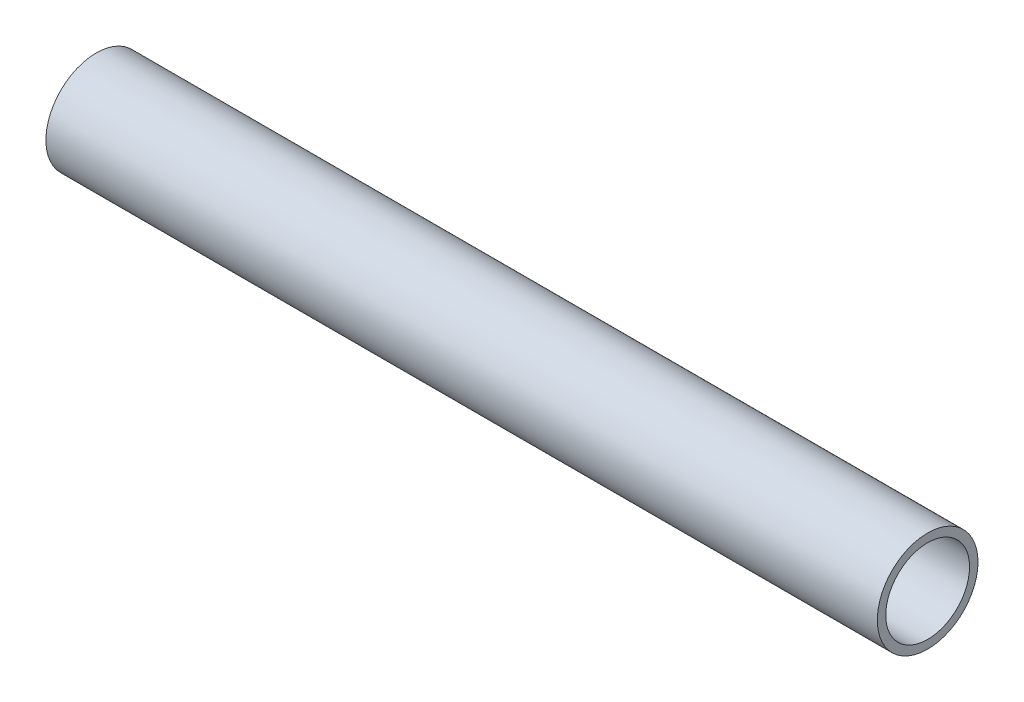
ISO-10303-21;
HEADER;
FILE_DESCRIPTION(('STEP AP214'),'2;1');
FILE_NAME('part.step','',(''),(''),'','','');
FILE_SCHEMA(('AUTOMOTIVE_DESIGN { 1 0 10303 214 1 1 1 1 }'));
ENDSEC;
DATA;
#1=APPLICATION_CONTEXT('core data for automotive mechanical design processes');
#2=APPLICATION_PROTOCOL_DEFINITION('international standard','automotive_design',2000,#1);
#3=PRODUCT_CONTEXT('',#1,'mechanical');
#4=PRODUCT('Part','Part','',(#3));
#5=PRODUCT_RELATED_PRODUCT_CATEGORY('part','',(#4));
#6=PRODUCT_DEFINITION_FORMATION('','',#4);
#7=PRODUCT_DEFINITION_CONTEXT('part definition',#1,'design');
#8=PRODUCT_DEFINITION('design','',#6,#7);
#9=PRODUCT_DEFINITION_SHAPE('','',#8);
#10=(LENGTH_UNIT() NAMED_UNIT(*) SI_UNIT(.MILLI.,.METRE.));
#11=(NAMED_UNIT(*) PLANE_ANGLE_UNIT() SI_UNIT($,.RADIAN.));
#12=(NAMED_UNIT(*) SI_UNIT($,.STERADIAN.) SOLID_ANGLE_UNIT());
#13=UNCERTAINTY_MEASURE_WITH_UNIT(LENGTH_MEASURE(1.E-05),#10,'distance_accuracy_value','');
#14=(GEOMETRIC_REPRESENTATION_CONTEXT(3) GLOBAL_UNCERTAINTY_ASSIGNED_CONTEXT((#13)) GLOBAL_UNIT_ASSIGNED_CONTEXT((#10,
#11,#12)) REPRESENTATION_CONTEXT('',''));
#15=CARTESIAN_POINT('',(0.,0.,0.));
#16=DIRECTION('',(0.,0.,1.));
#17=DIRECTION('',(1.,0.,0.));
#18=AXIS2_PLACEMENT_3D('',#15,#16,#17);
#19=CARTESIAN_POINT('',(-38.7684270759191,1471.85967450443,0.));
#20=DIRECTION('',(-1.,0.,0.));
#21=DIRECTION('',(0.,0.,1.));
#22=AXIS2_PLACEMENT_3D('',#19,#20,#21);
#23=CYLINDRICAL_SURFACE('',#22,5.28319999999993);
#24=CARTESIAN_POINT('',(-38.7684270759191,1471.85967450443,0.));
#25=DIRECTION('',(1.,0.,0.));
#26=DIRECTION('',(0.,0.,-1.));
#27=AXIS2_PLACEMENT_3D('',#24,#25,#26);
#28=CIRCLE('',#27,5.28319999999993);
#29=CARTESIAN_POINT('',(-38.7684270759191,1471.85967450443,-5.28319999999993));
#30=VERTEX_POINT('',#29);
#31=EDGE_CURVE('E45',#30,#30,#28,.T.);
#32=ORIENTED_EDGE('',*,*,#31,.T.);
#33=EDGE_LOOP('',(#32));
#34=FACE_BOUND('',#33,.T.);
#35=CARTESIAN_POINT('',(-143.613946582668,1471.85967450443,0.));
#36=DIRECTION('',(1.,0.,0.));
#37=DIRECTION('',(0.,0.,-1.));
#38=AXIS2_PLACEMENT_3D('',#35,#36,#37);
#39=CIRCLE('',#38,5.28319999999993);
#40=CARTESIAN_POINT('',(-143.613946582668,1471.85967450443,-5.28319999999993));
#41=VERTEX_POINT('',#40);
#42=EDGE_CURVE('E51',#41,#41,#39,.T.);
#43=ORIENTED_EDGE('',*,*,#42,.F.);
#44=EDGE_LOOP('',(#43));
#45=FACE_BOUND('',#44,.T.);
#46=ADVANCED_FACE('F38',(#34,#45),#23,.F.);
#47=CARTESIAN_POINT('',(-38.7684270759191,1471.85967450443,0.));
#48=DIRECTION('',(-1.,0.,0.));
#49=DIRECTION('',(0.,0.,1.));
#50=AXIS2_PLACEMENT_3D('',#47,#48,#49);
#51=CYLINDRICAL_SURFACE('',#50,6.34999999999994);
#52=CARTESIAN_POINT('',(-38.7684270759191,1471.85967450443,0.));
#53=DIRECTION('',(1.,0.,0.));
#54=DIRECTION('',(0.,0.,-1.));
#55=AXIS2_PLACEMENT_3D('',#52,#53,#54);
#56=CIRCLE('',#55,6.34999999999994);
#57=CARTESIAN_POINT('',(-38.7684270759191,1471.85967450443,-6.34999999999994));
#58=VERTEX_POINT('',#57);
#59=EDGE_CURVE('E11',#58,#58,#56,.T.);
#60=ORIENTED_EDGE('',*,*,#59,.F.);
#61=EDGE_LOOP('',(#60));
#62=FACE_BOUND('',#61,.T.);
#63=CARTESIAN_POINT('',(-143.613946582668,1471.85967450443,0.));
#64=DIRECTION('',(1.,0.,0.));
#65=DIRECTION('',(0.,0.,-1.));
#66=AXIS2_PLACEMENT_3D('',#63,#64,#65);
#67=CIRCLE('',#66,6.34999999999994);
#68=CARTESIAN_POINT('',(-143.613946582668,1471.85967450443,-6.34999999999994));
#69=VERTEX_POINT('',#68);
#70=EDGE_CURVE('E41',#69,#69,#67,.T.);
#71=ORIENTED_EDGE('',*,*,#70,.T.);
#72=EDGE_LOOP('',(#71));
#73=FACE_BOUND('',#72,.T.);
#74=ADVANCED_FACE('F58',(#62,#73),#51,.T.);
#75=CARTESIAN_POINT('',(-38.7684270759191,1471.85967450443,0.));
#76=DIRECTION('',(1.,0.,0.));
#77=DIRECTION('',(0.,0.,-1.));
#78=AXIS2_PLACEMENT_3D('',#75,#76,#77);
#79=PLANE('',#78);
#80=ORIENTED_EDGE('',*,*,#31,.F.);
#81=EDGE_LOOP('',(#80));
#82=FACE_BOUND('',#81,.T.);
#83=ORIENTED_EDGE('',*,*,#59,.T.);
#84=EDGE_LOOP('',(#83));
#85=FACE_BOUND('',#84,.T.);
#86=ADVANCED_FACE('F62',(#82,#85),#79,.T.);
#87=CARTESIAN_POINT('',(-143.613946582668,1471.85967450443,0.));
#88=DIRECTION('',(1.,0.,0.));
#89=DIRECTION('',(0.,0.,-1.));
#90=AXIS2_PLACEMENT_3D('',#87,#88,#89);
#91=PLANE('',#90);
#92=ORIENTED_EDGE('',*,*,#42,.T.);
#93=EDGE_LOOP('',(#92));
#94=FACE_BOUND('',#93,.T.);
#95=ORIENTED_EDGE('',*,*,#70,.F.);
#96=EDGE_LOOP('',(#95));
#97=FACE_BOUND('',#96,.T.);
#98=ADVANCED_FACE('F60',(#94,#97),#91,.F.);
#99=CLOSED_SHELL('',(#46,#74,#86,#98));
#100=MANIFOLD_SOLID_BREP('B2',#99);
#101=ADVANCED_BREP_SHAPE_REPRESENTATION('',(#18,#100),#14);
#102=SHAPE_DEFINITION_REPRESENTATION(#9,#101);
ENDSEC;
END-ISO-10303-21;
